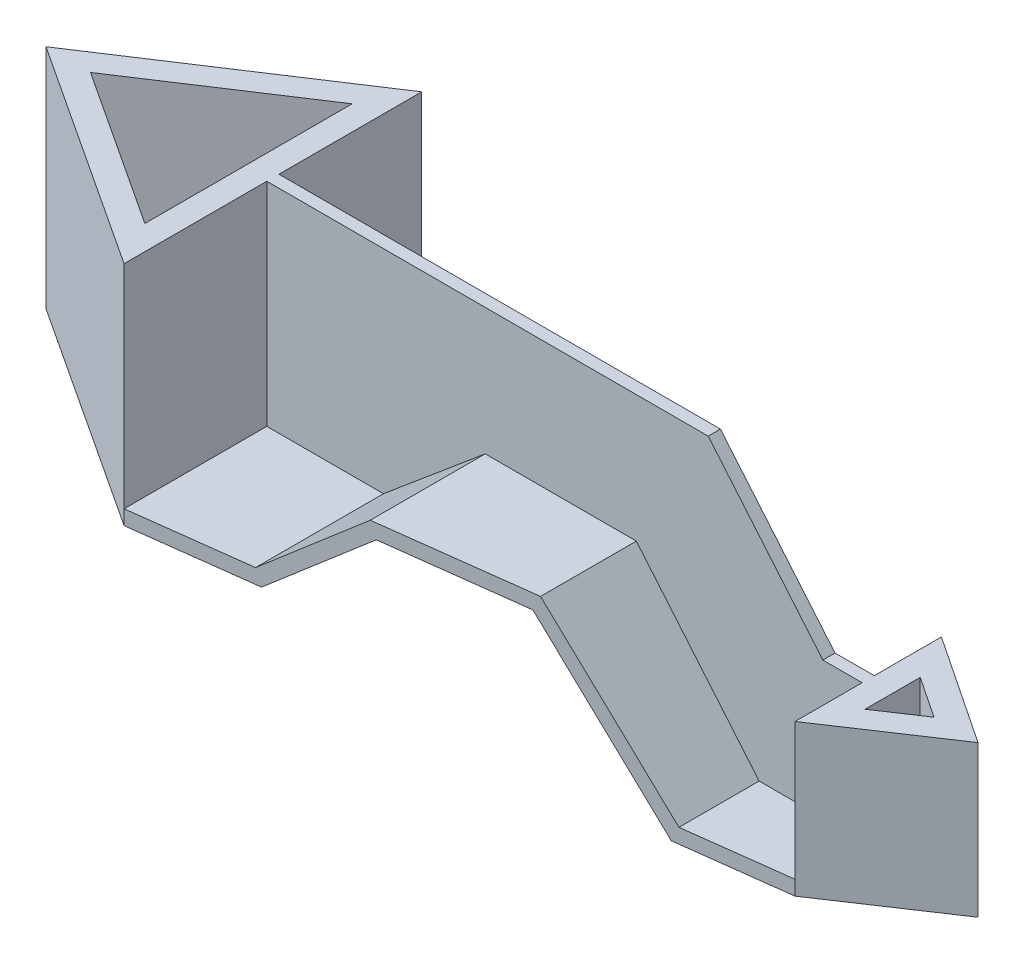
ISO-10303-21;
HEADER;
FILE_DESCRIPTION(('STEP AP214'),'2;1');
FILE_NAME('part.step','',(''),(''),'','','');
FILE_SCHEMA(('AUTOMOTIVE_DESIGN { 1 0 10303 214 1 1 1 1 }'));
ENDSEC;
DATA;
#1=APPLICATION_CONTEXT('core data for automotive mechanical design processes');
#2=APPLICATION_PROTOCOL_DEFINITION('international standard','automotive_design',2000,#1);
#3=PRODUCT_CONTEXT('',#1,'mechanical');
#4=PRODUCT('Part','Part','',(#3));
#5=PRODUCT_RELATED_PRODUCT_CATEGORY('part','',(#4));
#6=PRODUCT_DEFINITION_FORMATION('','',#4);
#7=PRODUCT_DEFINITION_CONTEXT('part definition',#1,'design');
#8=PRODUCT_DEFINITION('design','',#6,#7);
#9=PRODUCT_DEFINITION_SHAPE('','',#8);
#10=(LENGTH_UNIT() NAMED_UNIT(*) SI_UNIT(.MILLI.,.METRE.));
#11=(NAMED_UNIT(*) PLANE_ANGLE_UNIT() SI_UNIT($,.RADIAN.));
#12=(NAMED_UNIT(*) SI_UNIT($,.STERADIAN.) SOLID_ANGLE_UNIT());
#13=UNCERTAINTY_MEASURE_WITH_UNIT(LENGTH_MEASURE(1.E-05),#10,'distance_accuracy_value','');
#14=(GEOMETRIC_REPRESENTATION_CONTEXT(3) GLOBAL_UNCERTAINTY_ASSIGNED_CONTEXT((#13)) GLOBAL_UNIT_ASSIGNED_CONTEXT((#10,
#11,#12)) REPRESENTATION_CONTEXT('',''));
#15=CARTESIAN_POINT('',(0.,0.,0.));
#16=DIRECTION('',(0.,0.,1.));
#17=DIRECTION('',(1.,0.,0.));
#18=AXIS2_PLACEMENT_3D('',#15,#16,#17);
#19=CARTESIAN_POINT('',(0.,93.,61.));
#20=DIRECTION('',(-1.,0.,0.));
#21=DIRECTION('',(0.,0.,1.));
#22=AXIS2_PLACEMENT_3D('',#19,#20,#21);
#23=PLANE('',#22);
#24=DIRECTION('',(0.,-1.,0.));
#25=VECTOR('',#24,1.);
#26=CARTESIAN_POINT('',(0.,93.,-2.5));
#27=LINE('',#26,#25);
#28=CARTESIAN_POINT('',(0.,93.,-2.49999999999997));
#29=VERTEX_POINT('',#28);
#30=CARTESIAN_POINT('',(0.,6.,-2.49999999999997));
#31=VERTEX_POINT('',#30);
#32=EDGE_CURVE('E386',#29,#31,#27,.T.);
#33=ORIENTED_EDGE('',*,*,#32,.T.);
#34=DIRECTION('',(0.,0.,-1.));
#35=VECTOR('',#34,1.);
#36=CARTESIAN_POINT('',(0.,6.,61.));
#37=LINE('',#36,#35);
#38=CARTESIAN_POINT('',(0.,6.00000000000003,-61.));
#39=VERTEX_POINT('',#38);
#40=EDGE_CURVE('E296',#31,#39,#37,.T.);
#41=ORIENTED_EDGE('',*,*,#40,.T.);
#42=DIRECTION('',(0.,-1.,0.));
#43=VECTOR('',#42,1.);
#44=CARTESIAN_POINT('',(0.,93.,-61.));
#45=LINE('',#44,#43);
#46=CARTESIAN_POINT('',(0.,93.,-61.));
#47=VERTEX_POINT('',#46);
#48=EDGE_CURVE('E359',#47,#39,#45,.T.);
#49=ORIENTED_EDGE('',*,*,#48,.F.);
#50=DIRECTION('',(0.,0.,-1.));
#51=VECTOR('',#50,1.);
#52=CARTESIAN_POINT('',(0.,93.,61.));
#53=LINE('',#52,#51);
#54=EDGE_CURVE('E55',#29,#47,#53,.T.);
#55=ORIENTED_EDGE('',*,*,#54,.F.);
#56=EDGE_LOOP('',(#33,#41,#49,#55));
#57=FACE_BOUND('',#56,.T.);
#58=ADVANCED_FACE('F37',(#57),#23,.F.);
#59=CARTESIAN_POINT('',(201.79784594893,-19.,61.));
#60=DIRECTION('',(0.,-1.,0.));
#61=DIRECTION('',(0.,0.,-1.));
#62=AXIS2_PLACEMENT_3D('',#59,#60,#61);
#63=PLANE('',#62);
#64=DIRECTION('',(0.,0.,-1.));
#65=VECTOR('',#64,1.);
#66=CARTESIAN_POINT('',(244.,-19.,61.));
#67=LINE('',#66,#65);
#68=CARTESIAN_POINT('',(244.,-19.,-2.5));
#69=VERTEX_POINT('',#68);
#70=CARTESIAN_POINT('',(244.,-19.,-30.));
#71=VERTEX_POINT('',#70);
#72=EDGE_CURVE('E313',#69,#71,#67,.T.);
#73=ORIENTED_EDGE('',*,*,#72,.T.);
#74=DIRECTION('',(-0.992025662364217,0.,-0.126036047267585));
#75=VECTOR('',#74,1.);
#76=CARTESIAN_POINT('',(213.8460511499,-19.,-33.8310344850537));
#77=LINE('',#76,#75);
#78=CARTESIAN_POINT('',(201.79784594893,-19.,-35.3617490802589));
#79=VERTEX_POINT('',#78);
#80=EDGE_CURVE('E255',#71,#79,#77,.T.);
#81=ORIENTED_EDGE('',*,*,#80,.T.);
#82=DIRECTION('',(0.,0.,-1.));
#83=VECTOR('',#82,1.);
#84=CARTESIAN_POINT('',(201.79784594893,-19.,61.));
#85=LINE('',#84,#83);
#86=CARTESIAN_POINT('',(201.79784594893,-19.,-2.49999999999997));
#87=VERTEX_POINT('',#86);
#88=EDGE_CURVE('E310',#87,#79,#85,.T.);
#89=ORIENTED_EDGE('',*,*,#88,.F.);
#90=DIRECTION('',(1.,0.,0.));
#91=VECTOR('',#90,1.);
#92=CARTESIAN_POINT('',(201.79784594893,-19.,-2.5));
#93=LINE('',#92,#91);
#94=EDGE_CURVE('E430',#87,#69,#93,.T.);
#95=ORIENTED_EDGE('',*,*,#94,.T.);
#96=EDGE_LOOP('',(#73,#81,#89,#95));
#97=FACE_BOUND('',#96,.T.);
#98=ADVANCED_FACE('F580',(#97),#63,.F.);
#99=CARTESIAN_POINT('',(151.451868078293,41.,61.));
#100=DIRECTION('',(-0.766044443118979,-0.642787609686538,0.));
#101=DIRECTION('',(0.642787609686538,-0.766044443118979,0.));
#102=AXIS2_PLACEMENT_3D('',#99,#100,#101);
#103=PLANE('',#102);
#104=ORIENTED_EDGE('',*,*,#88,.T.);
#105=DIRECTION('',(-0.640654807784987,0.763502668790514,-0.0813946682021909));
#106=VECTOR('',#105,1.);
#107=CARTESIAN_POINT('',(156.810283549363,34.61408911174,-41.0773820080727));
#108=LINE('',#107,#106);
#109=CARTESIAN_POINT('',(151.451868078293,41.,-41.7581643015283));
#110=VERTEX_POINT('',#109);
#111=EDGE_CURVE('E550',#79,#110,#108,.T.);
#112=ORIENTED_EDGE('',*,*,#111,.T.);
#113=DIRECTION('',(0.,0.,-1.));
#114=VECTOR('',#113,1.);
#115=CARTESIAN_POINT('',(151.451868078293,41.,61.));
#116=LINE('',#115,#114);
#117=CARTESIAN_POINT('',(151.451868078293,41.,-2.49999999999997));
#118=VERTEX_POINT('',#117);
#119=EDGE_CURVE('E307',#118,#110,#116,.T.);
#120=ORIENTED_EDGE('',*,*,#119,.F.);
#121=DIRECTION('',(0.642787609686538,-0.766044443118979,0.));
#122=VECTOR('',#121,1.);
#123=CARTESIAN_POINT('',(151.451868078293,41.,-2.5));
#124=LINE('',#123,#122);
#125=EDGE_CURVE('E428',#118,#87,#124,.T.);
#126=ORIENTED_EDGE('',*,*,#125,.T.);
#127=EDGE_LOOP('',(#104,#112,#120,#126));
#128=FACE_BOUND('',#127,.T.);
#129=ADVANCED_FACE('F584',(#128),#103,.F.);
#130=CARTESIAN_POINT('',(89.5275543352001,41.,61.));
#131=DIRECTION('',(0.,-1.,0.));
#132=DIRECTION('',(0.,0.,-1.));
#133=AXIS2_PLACEMENT_3D('',#130,#131,#132);
#134=PLANE('',#133);
#135=ORIENTED_EDGE('',*,*,#119,.T.);
#136=DIRECTION('',(-0.992025662364217,0.,-0.126036047267585));
#137=VECTOR('',#136,1.);
#138=CARTESIAN_POINT('',(103.3591826851,41.,-47.8683005604997));
#139=LINE('',#138,#137);
#140=CARTESIAN_POINT('',(89.5275543352001,41.,-49.6255976049541));
#141=VERTEX_POINT('',#140);
#142=EDGE_CURVE('E547',#110,#141,#139,.T.);
#143=ORIENTED_EDGE('',*,*,#142,.T.);
#144=DIRECTION('',(0.,0.,-1.));
#145=VECTOR('',#144,1.);
#146=CARTESIAN_POINT('',(89.5275543352001,41.,61.));
#147=LINE('',#146,#145);
#148=CARTESIAN_POINT('',(89.5275543352001,41.,-2.49999999999997));
#149=VERTEX_POINT('',#148);
#150=EDGE_CURVE('E304',#149,#141,#147,.T.);
#151=ORIENTED_EDGE('',*,*,#150,.F.);
#152=DIRECTION('',(1.,0.,0.));
#153=VECTOR('',#152,1.);
#154=CARTESIAN_POINT('',(89.5275543352001,41.,-2.5));
#155=LINE('',#154,#153);
#156=EDGE_CURVE('E426',#149,#118,#155,.T.);
#157=ORIENTED_EDGE('',*,*,#156,.T.);
#158=EDGE_LOOP('',(#135,#143,#151,#157));
#159=FACE_BOUND('',#158,.T.);
#160=ADVANCED_FACE('F602',(#159),#134,.F.);
#161=CARTESIAN_POINT('',(47.8161785944028,6.,61.));
#162=DIRECTION('',(0.64278760968654,-0.766044443118977,0.));
#163=DIRECTION('',(0.766044443118977,0.64278760968654,0.));
#164=AXIS2_PLACEMENT_3D('',#161,#162,#163);
#165=PLANE('',#164);
#166=ORIENTED_EDGE('',*,*,#150,.T.);
#167=DIRECTION('',(-0.762441945897458,-0.639764755596646,-0.0968676242738574));
#168=VECTOR('',#167,1.);
#169=CARTESIAN_POINT('',(56.3779279675641,13.184160741252,-53.8372304631373));
#170=LINE('',#169,#168);
#171=CARTESIAN_POINT('',(47.8161785944028,6.,-54.9249937031702));
#172=VERTEX_POINT('',#171);
#173=EDGE_CURVE('E544',#141,#172,#170,.T.);
#174=ORIENTED_EDGE('',*,*,#173,.T.);
#175=DIRECTION('',(0.,0.,-1.));
#176=VECTOR('',#175,1.);
#177=CARTESIAN_POINT('',(47.8161785944028,6.,61.));
#178=LINE('',#177,#176);
#179=CARTESIAN_POINT('',(47.8161785944028,6.,-2.49999999999997));
#180=VERTEX_POINT('',#179);
#181=EDGE_CURVE('E301',#180,#172,#178,.T.);
#182=ORIENTED_EDGE('',*,*,#181,.F.);
#183=DIRECTION('',(0.766044443118977,0.64278760968654,0.));
#184=VECTOR('',#183,1.);
#185=CARTESIAN_POINT('',(47.8161785944028,6.,-2.5));
#186=LINE('',#185,#184);
#187=EDGE_CURVE('E424',#180,#149,#186,.T.);
#188=ORIENTED_EDGE('',*,*,#187,.T.);
#189=EDGE_LOOP('',(#166,#174,#182,#188));
#190=FACE_BOUND('',#189,.T.);
#191=ADVANCED_FACE('F599',(#190),#165,.F.);
#192=CARTESIAN_POINT('',(0.,6.,61.));
#193=DIRECTION('',(0.,-1.,0.));
#194=DIRECTION('',(0.,0.,-1.));
#195=AXIS2_PLACEMENT_3D('',#192,#193,#194);
#196=PLANE('',#195);
#197=ORIENTED_EDGE('',*,*,#181,.T.);
#198=DIRECTION('',(-0.992025662364217,0.,-0.126036047267585));
#199=VECTOR('',#198,1.);
#200=CARTESIAN_POINT('',(15.253781179232,6.,-59.0620196042779));
#201=LINE('',#200,#199);
#202=EDGE_CURVE('E537',#172,#39,#201,.T.);
#203=ORIENTED_EDGE('',*,*,#202,.T.);
#204=ORIENTED_EDGE('',*,*,#40,.F.);
#205=DIRECTION('',(1.,0.,0.));
#206=VECTOR('',#205,1.);
#207=CARTESIAN_POINT('',(0.,6.,-2.5));
#208=LINE('',#207,#206);
#209=EDGE_CURVE('E389',#31,#180,#208,.T.);
#210=ORIENTED_EDGE('',*,*,#209,.T.);
#211=EDGE_LOOP('',(#197,#203,#204,#210));
#212=FACE_BOUND('',#211,.T.);
#213=ADVANCED_FACE('F592',(#212),#196,.F.);
#214=CARTESIAN_POINT('',(244.,37.,61.));
#215=DIRECTION('',(1.,0.,0.));
#216=DIRECTION('',(0.,0.,-1.));
#217=AXIS2_PLACEMENT_3D('',#214,#215,#216);
#218=PLANE('',#217);
#219=DIRECTION('',(0.,1.,0.));
#220=VECTOR('',#219,1.);
#221=CARTESIAN_POINT('',(244.,-19.,-2.5));
#222=LINE('',#221,#220);
#223=CARTESIAN_POINT('',(244.,37.,-2.5));
#224=VERTEX_POINT('',#223);
#225=EDGE_CURVE('E433',#69,#224,#222,.T.);
#226=ORIENTED_EDGE('',*,*,#225,.T.);
#227=DIRECTION('',(0.,0.,1.));
#228=VECTOR('',#227,1.);
#229=CARTESIAN_POINT('',(244.,37.,61.));
#230=LINE('',#229,#228);
#231=CARTESIAN_POINT('',(244.,37.,-30.));
#232=VERTEX_POINT('',#231);
#233=EDGE_CURVE('E284',#232,#224,#230,.T.);
#234=ORIENTED_EDGE('',*,*,#233,.F.);
#235=DIRECTION('',(0.,-1.,0.));
#236=VECTOR('',#235,1.);
#237=CARTESIAN_POINT('',(244.,37.,-30.));
#238=LINE('',#237,#236);
#239=EDGE_CURVE('E262',#232,#71,#238,.T.);
#240=ORIENTED_EDGE('',*,*,#239,.T.);
#241=ORIENTED_EDGE('',*,*,#72,.F.);
#242=EDGE_LOOP('',(#226,#234,#240,#241));
#243=FACE_BOUND('',#242,.T.);
#244=ADVANCED_FACE('F477',(#243),#218,.F.);
#245=CARTESIAN_POINT('',(0.,93.,0.));
#246=DIRECTION('',(0.,1.,0.));
#247=DIRECTION('',(0.,0.,1.));
#248=AXIS2_PLACEMENT_3D('',#245,#246,#247);
#249=PLANE('',#248);
#250=DIRECTION('',(-0.836176771121185,0.,0.548460032670885));
#251=VECTOR('',#250,1.);
#252=CARTESIAN_POINT('',(0.,93.,-61.));
#253=LINE('',#252,#251);
#254=CARTESIAN_POINT('',(-93.,93.,0.));
#255=VERTEX_POINT('',#254);
#256=EDGE_CURVE('E351',#47,#255,#253,.T.);
#257=ORIENTED_EDGE('',*,*,#256,.T.);
#258=DIRECTION('',(0.836176771121185,0.,0.548460032670885));
#259=VECTOR('',#258,1.);
#260=CARTESIAN_POINT('',(-93.,93.,0.));
#261=LINE('',#260,#259);
#262=CARTESIAN_POINT('',(0.,93.,61.));
#263=VERTEX_POINT('',#262);
#264=EDGE_CURVE('E354',#255,#263,#261,.T.);
#265=ORIENTED_EDGE('',*,*,#264,.T.);
#266=CARTESIAN_POINT('',(0.,93.,2.50000000000002));
#267=VERTEX_POINT('',#266);
#268=EDGE_CURVE('E357',#263,#267,#53,.T.);
#269=ORIENTED_EDGE('',*,*,#268,.T.);
#270=DIRECTION('',(-1.,0.,0.));
#271=VECTOR('',#270,1.);
#272=CARTESIAN_POINT('',(0.,93.,2.5));
#273=LINE('',#272,#271);
#274=CARTESIAN_POINT('',(180.921495459683,93.,2.5));
#275=VERTEX_POINT('',#274);
#276=EDGE_CURVE('E419',#275,#267,#273,.T.);
#277=ORIENTED_EDGE('',*,*,#276,.F.);
#278=DIRECTION('',(0.,0.,-1.));
#279=VECTOR('',#278,1.);
#280=CARTESIAN_POINT('',(180.921495459683,93.,2.5));
#281=LINE('',#280,#279);
#282=CARTESIAN_POINT('',(180.921495459683,93.,-2.5));
#283=VERTEX_POINT('',#282);
#284=EDGE_CURVE('E421',#275,#283,#281,.T.);
#285=ORIENTED_EDGE('',*,*,#284,.T.);
#286=DIRECTION('',(-1.,0.,0.));
#287=VECTOR('',#286,1.);
#288=CARTESIAN_POINT('',(0.,93.,-2.5));
#289=LINE('',#288,#287);
#290=EDGE_CURVE('E397',#283,#29,#289,.T.);
#291=ORIENTED_EDGE('',*,*,#290,.T.);
#292=ORIENTED_EDGE('',*,*,#54,.T.);
#293=EDGE_LOOP('',(#257,#265,#269,#277,#285,#291,#292));
#294=FACE_BOUND('',#293,.T.);
#295=DIRECTION('',(-0.836176771121186,0.,0.548460032670885));
#296=VECTOR('',#295,1.);
#297=CARTESIAN_POINT('',(-10.,93.,-42.4816664830974));
#298=LINE('',#297,#296);
#299=CARTESIAN_POINT('',(-10.,93.,-42.4816664830974));
#300=VERTEX_POINT('',#299);
#301=CARTESIAN_POINT('',(-74.7671308676731,93.,0.));
#302=VERTEX_POINT('',#301);
#303=EDGE_CURVE('E329',#300,#302,#298,.T.);
#304=ORIENTED_EDGE('',*,*,#303,.F.);
#305=DIRECTION('',(0.,0.,-1.));
#306=VECTOR('',#305,1.);
#307=CARTESIAN_POINT('',(-10.,93.,42.4816664830974));
#308=LINE('',#307,#306);
#309=CARTESIAN_POINT('',(-10.,93.,42.4816664830974));
#310=VERTEX_POINT('',#309);
#311=EDGE_CURVE('E327',#310,#300,#308,.T.);
#312=ORIENTED_EDGE('',*,*,#311,.F.);
#313=DIRECTION('',(0.836176771121185,0.,0.548460032670885));
#314=VECTOR('',#313,1.);
#315=CARTESIAN_POINT('',(-74.7671308676731,93.,0.));
#316=LINE('',#315,#314);
#317=EDGE_CURVE('E333',#302,#310,#316,.T.);
#318=ORIENTED_EDGE('',*,*,#317,.F.);
#319=EDGE_LOOP('',(#304,#312,#318));
#320=FACE_BOUND('',#319,.T.);
#321=ADVANCED_FACE('F638',(#294,#320),#249,.T.);
#322=CARTESIAN_POINT('',(0.,0.,0.));
#323=DIRECTION('',(0.,1.,0.));
#324=DIRECTION('',(0.,0.,1.));
#325=AXIS2_PLACEMENT_3D('',#322,#323,#324);
#326=PLANE('',#325);
#327=DIRECTION('',(-0.836176771121185,0.,0.548460032670885));
#328=VECTOR('',#327,1.);
#329=CARTESIAN_POINT('',(0.,0.,-61.));
#330=LINE('',#329,#328);
#331=CARTESIAN_POINT('',(0.,0.,-61.));
#332=VERTEX_POINT('',#331);
#333=CARTESIAN_POINT('',(-93.,0.,0.));
#334=VERTEX_POINT('',#333);
#335=EDGE_CURVE('E350',#332,#334,#330,.T.);
#336=ORIENTED_EDGE('',*,*,#335,.F.);
#337=DIRECTION('',(0.992025662364217,0.,0.126036047267585));
#338=VECTOR('',#337,1.);
#339=CARTESIAN_POINT('',(7.62689058961601,0.,-60.031009802139));
#340=LINE('',#339,#338);
#341=CARTESIAN_POINT('',(50.,0.,-54.6475409836066));
#342=VERTEX_POINT('',#341);
#343=EDGE_CURVE('E381',#332,#342,#340,.T.);
#344=ORIENTED_EDGE('',*,*,#343,.T.);
#345=DIRECTION('',(0.,0.,-1.));
#346=VECTOR('',#345,1.);
#347=CARTESIAN_POINT('',(50.,0.,61.));
#348=LINE('',#347,#346);
#349=CARTESIAN_POINT('',(50.,0.,54.6475409836066));
#350=VERTEX_POINT('',#349);
#351=EDGE_CURVE('E323',#350,#342,#348,.T.);
#352=ORIENTED_EDGE('',*,*,#351,.F.);
#353=DIRECTION('',(-0.992025662364217,0.,0.126036047267585));
#354=VECTOR('',#353,1.);
#355=CARTESIAN_POINT('',(7.62689058961601,0.,60.031009802139));
#356=LINE('',#355,#354);
#357=CARTESIAN_POINT('',(0.,0.,61.));
#358=VERTEX_POINT('',#357);
#359=EDGE_CURVE('E383',#350,#358,#356,.T.);
#360=ORIENTED_EDGE('',*,*,#359,.T.);
#361=DIRECTION('',(0.836176771121185,0.,0.548460032670885));
#362=VECTOR('',#361,1.);
#363=CARTESIAN_POINT('',(-93.,0.,0.));
#364=LINE('',#363,#362);
#365=EDGE_CURVE('E355',#334,#358,#364,.T.);
#366=ORIENTED_EDGE('',*,*,#365,.F.);
#367=EDGE_LOOP('',(#336,#344,#352,#360,#366));
#368=FACE_BOUND('',#367,.T.);
#369=DIRECTION('',(0.,0.,-1.));
#370=VECTOR('',#369,1.);
#371=CARTESIAN_POINT('',(-10.,0.,42.4816664830974));
#372=LINE('',#371,#370);
#373=CARTESIAN_POINT('',(-10.,0.,42.4816664830974));
#374=VERTEX_POINT('',#373);
#375=CARTESIAN_POINT('',(-10.,0.,-42.4816664830974));
#376=VERTEX_POINT('',#375);
#377=EDGE_CURVE('E326',#374,#376,#372,.T.);
#378=ORIENTED_EDGE('',*,*,#377,.T.);
#379=DIRECTION('',(-0.836176771121186,0.,0.548460032670885));
#380=VECTOR('',#379,1.);
#381=CARTESIAN_POINT('',(-10.,0.,-42.4816664830974));
#382=LINE('',#381,#380);
#383=CARTESIAN_POINT('',(-74.7671308676731,0.,0.));
#384=VERTEX_POINT('',#383);
#385=EDGE_CURVE('E338',#376,#384,#382,.T.);
#386=ORIENTED_EDGE('',*,*,#385,.T.);
#387=DIRECTION('',(0.836176771121185,0.,0.548460032670885));
#388=VECTOR('',#387,1.);
#389=CARTESIAN_POINT('',(-74.7671308676731,0.,0.));
#390=LINE('',#389,#388);
#391=EDGE_CURVE('E330',#384,#374,#390,.T.);
#392=ORIENTED_EDGE('',*,*,#391,.T.);
#393=EDGE_LOOP('',(#378,#386,#392));
#394=FACE_BOUND('',#393,.T.);
#395=ADVANCED_FACE('F378',(#368,#394),#326,.F.);
#396=CARTESIAN_POINT('',(0.,93.,-61.));
#397=DIRECTION('',(0.548460032670885,0.,0.836176771121185));
#398=DIRECTION('',(0.836176771121186,0.,-0.548460032670885));
#399=AXIS2_PLACEMENT_3D('',#396,#397,#398);
#400=PLANE('',#399);
#401=ORIENTED_EDGE('',*,*,#335,.T.);
#402=DIRECTION('',(0.,-1.,0.));
#403=VECTOR('',#402,1.);
#404=CARTESIAN_POINT('',(-93.,93.,0.));
#405=LINE('',#404,#403);
#406=EDGE_CURVE('E41',#255,#334,#405,.T.);
#407=ORIENTED_EDGE('',*,*,#406,.F.);
#408=ORIENTED_EDGE('',*,*,#256,.F.);
#409=ORIENTED_EDGE('',*,*,#48,.T.);
#410=DIRECTION('',(0.,-1.,0.));
#411=VECTOR('',#410,1.);
#412=CARTESIAN_POINT('',(0.,6.,-61.));
#413=LINE('',#412,#411);
#414=EDGE_CURVE('E293',#39,#332,#413,.T.);
#415=ORIENTED_EDGE('',*,*,#414,.T.);
#416=EDGE_LOOP('',(#401,#407,#408,#409,#415));
#417=FACE_BOUND('',#416,.T.);
#418=ADVANCED_FACE('F39',(#417),#400,.F.);
#419=CARTESIAN_POINT('',(-93.,93.,0.));
#420=DIRECTION('',(0.548460032670885,0.,-0.836176771121185));
#421=DIRECTION('',(-0.836176771121186,0.,-0.548460032670885));
#422=AXIS2_PLACEMENT_3D('',#419,#420,#421);
#423=PLANE('',#422);
#424=ORIENTED_EDGE('',*,*,#365,.T.);
#425=DIRECTION('',(0.,-1.,0.));
#426=VECTOR('',#425,1.);
#427=CARTESIAN_POINT('',(0.,6.,61.));
#428=LINE('',#427,#426);
#429=CARTESIAN_POINT('',(0.,5.99999999999999,61.));
#430=VERTEX_POINT('',#429);
#431=EDGE_CURVE('E294',#430,#358,#428,.T.);
#432=ORIENTED_EDGE('',*,*,#431,.F.);
#433=DIRECTION('',(0.,-1.,0.));
#434=VECTOR('',#433,1.);
#435=CARTESIAN_POINT('',(0.,93.,61.));
#436=LINE('',#435,#434);
#437=EDGE_CURVE('E365',#263,#430,#436,.T.);
#438=ORIENTED_EDGE('',*,*,#437,.F.);
#439=ORIENTED_EDGE('',*,*,#264,.F.);
#440=ORIENTED_EDGE('',*,*,#406,.T.);
#441=EDGE_LOOP('',(#424,#432,#438,#439,#440));
#442=FACE_BOUND('',#441,.T.);
#443=ADVANCED_FACE('F371',(#442),#423,.F.);
#444=CARTESIAN_POINT('',(0.,6.,2.50000000000002));
#445=VERTEX_POINT('',#444);
#446=EDGE_CURVE('E299',#430,#445,#37,.T.);
#447=ORIENTED_EDGE('',*,*,#446,.T.);
#448=DIRECTION('',(0.,-1.,0.));
#449=VECTOR('',#448,1.);
#450=CARTESIAN_POINT('',(0.,93.,2.5));
#451=LINE('',#450,#449);
#452=EDGE_CURVE('E63',#267,#445,#451,.T.);
#453=ORIENTED_EDGE('',*,*,#452,.F.);
#454=ORIENTED_EDGE('',*,*,#268,.F.);
#455=ORIENTED_EDGE('',*,*,#437,.T.);
#456=EDGE_LOOP('',(#447,#453,#454,#455));
#457=FACE_BOUND('',#456,.T.);
#458=ADVANCED_FACE('F567',(#457),#23,.F.);
#459=CARTESIAN_POINT('',(-10.,93.,42.4816664830974));
#460=DIRECTION('',(-1.,0.,0.));
#461=DIRECTION('',(0.,0.,1.));
#462=AXIS2_PLACEMENT_3D('',#459,#460,#461);
#463=PLANE('',#462);
#464=ORIENTED_EDGE('',*,*,#377,.F.);
#465=DIRECTION('',(0.,-1.,0.));
#466=VECTOR('',#465,1.);
#467=CARTESIAN_POINT('',(-10.,93.,42.4816664830974));
#468=LINE('',#467,#466);
#469=EDGE_CURVE('E335',#310,#374,#468,.T.);
#470=ORIENTED_EDGE('',*,*,#469,.F.);
#471=ORIENTED_EDGE('',*,*,#311,.T.);
#472=DIRECTION('',(0.,-1.,0.));
#473=VECTOR('',#472,1.);
#474=CARTESIAN_POINT('',(-10.,93.,-42.4816664830974));
#475=LINE('',#474,#473);
#476=EDGE_CURVE('E347',#300,#376,#475,.T.);
#477=ORIENTED_EDGE('',*,*,#476,.T.);
#478=EDGE_LOOP('',(#464,#470,#471,#477));
#479=FACE_BOUND('',#478,.T.);
#480=ADVANCED_FACE('F569',(#479),#463,.T.);
#481=CARTESIAN_POINT('',(-10.,93.,-42.4816664830974));
#482=DIRECTION('',(0.548460032670885,0.,0.836176771121186));
#483=DIRECTION('',(0.836176771121186,0.,-0.548460032670885));
#484=AXIS2_PLACEMENT_3D('',#481,#482,#483);
#485=PLANE('',#484);
#486=ORIENTED_EDGE('',*,*,#385,.F.);
#487=ORIENTED_EDGE('',*,*,#476,.F.);
#488=ORIENTED_EDGE('',*,*,#303,.T.);
#489=DIRECTION('',(0.,-1.,0.));
#490=VECTOR('',#489,1.);
#491=CARTESIAN_POINT('',(-74.7671308676731,93.,0.));
#492=LINE('',#491,#490);
#493=EDGE_CURVE('E345',#302,#384,#492,.T.);
#494=ORIENTED_EDGE('',*,*,#493,.T.);
#495=EDGE_LOOP('',(#486,#487,#488,#494));
#496=FACE_BOUND('',#495,.T.);
#497=ADVANCED_FACE('F575',(#496),#485,.T.);
#498=CARTESIAN_POINT('',(-74.7671308676731,93.,0.));
#499=DIRECTION('',(0.548460032670885,0.,-0.836176771121186));
#500=DIRECTION('',(-0.836176771121186,0.,-0.548460032670885));
#501=AXIS2_PLACEMENT_3D('',#498,#499,#500);
#502=PLANE('',#501);
#503=ORIENTED_EDGE('',*,*,#391,.F.);
#504=ORIENTED_EDGE('',*,*,#493,.F.);
#505=ORIENTED_EDGE('',*,*,#317,.T.);
#506=ORIENTED_EDGE('',*,*,#469,.T.);
#507=EDGE_LOOP('',(#503,#504,#505,#506));
#508=FACE_BOUND('',#507,.T.);
#509=ADVANCED_FACE('F631',(#508),#502,.T.);
#510=CARTESIAN_POINT('',(50.,0.,61.));
#511=DIRECTION('',(-0.64278760968654,0.766044443118977,0.));
#512=DIRECTION('',(-0.766044443118977,-0.64278760968654,0.));
#513=AXIS2_PLACEMENT_3D('',#510,#511,#512);
#514=PLANE('',#513);
#515=ORIENTED_EDGE('',*,*,#351,.T.);
#516=DIRECTION('',(0.762441945897458,0.639764755596646,0.0968676242738573));
#517=VECTOR('',#516,1.);
#518=CARTESIAN_POINT('',(58.5412578417674,7.16696630481711,-53.562381175841));
#519=LINE('',#518,#517);
#520=CARTESIAN_POINT('',(91.7113757407973,35.,-49.3481448853905));
#521=VERTEX_POINT('',#520);
#522=EDGE_CURVE('E534',#342,#521,#519,.T.);
#523=ORIENTED_EDGE('',*,*,#522,.T.);
#524=DIRECTION('',(0.,0.,-1.));
#525=VECTOR('',#524,1.);
#526=CARTESIAN_POINT('',(91.7113757407973,35.,61.));
#527=LINE('',#526,#525);
#528=CARTESIAN_POINT('',(91.7113757407973,35.,49.3481448853905));
#529=VERTEX_POINT('',#528);
#530=EDGE_CURVE('E320',#529,#521,#527,.T.);
#531=ORIENTED_EDGE('',*,*,#530,.F.);
#532=DIRECTION('',(-0.762441945897458,-0.639764755596646,0.0968676242738573));
#533=VECTOR('',#532,1.);
#534=CARTESIAN_POINT('',(49.530833168377,-0.393677715375524,54.7071482450013));
#535=LINE('',#534,#533);
#536=EDGE_CURVE('E387',#529,#350,#535,.T.);
#537=ORIENTED_EDGE('',*,*,#536,.T.);
#538=EDGE_LOOP('',(#515,#523,#531,#537));
#539=FACE_BOUND('',#538,.T.);
#540=ADVANCED_FACE('F533',(#539),#514,.F.);
#541=CARTESIAN_POINT('',(91.7113757407973,35.,61.));
#542=DIRECTION('',(0.,1.,0.));
#543=DIRECTION('',(0.,0.,1.));
#544=AXIS2_PLACEMENT_3D('',#541,#542,#543);
#545=PLANE('',#544);
#546=ORIENTED_EDGE('',*,*,#530,.T.);
#547=DIRECTION('',(0.992025662364217,0.,0.126036047267585));
#548=VECTOR('',#547,1.);
#549=CARTESIAN_POINT('',(105.508313901584,35.,-47.5952552010283));
#550=LINE('',#549,#548);
#551=CARTESIAN_POINT('',(148.654022129363,35.,-42.1136283360235));
#552=VERTEX_POINT('',#551);
#553=EDGE_CURVE('E535',#521,#552,#550,.T.);
#554=ORIENTED_EDGE('',*,*,#553,.T.);
#555=DIRECTION('',(0.,0.,-1.));
#556=VECTOR('',#555,1.);
#557=CARTESIAN_POINT('',(148.654022129363,35.,61.));
#558=LINE('',#557,#556);
#559=CARTESIAN_POINT('',(148.654022129363,35.,42.1136283360235));
#560=VERTEX_POINT('',#559);
#561=EDGE_CURVE('E317',#560,#552,#558,.T.);
#562=ORIENTED_EDGE('',*,*,#561,.F.);
#563=DIRECTION('',(-0.992025662364217,0.,0.126036047267585));
#564=VECTOR('',#563,1.);
#565=CARTESIAN_POINT('',(90.2545327223516,35.,49.5332355967504));
#566=LINE('',#565,#564);
#567=EDGE_CURVE('E391',#560,#529,#566,.T.);
#568=ORIENTED_EDGE('',*,*,#567,.T.);
#569=EDGE_LOOP('',(#546,#554,#562,#568));
#570=FACE_BOUND('',#569,.T.);
#571=ADVANCED_FACE('F529',(#570),#545,.F.);
#572=CARTESIAN_POINT('',(148.654022129363,35.,61.));
#573=DIRECTION('',(0.766044443118979,0.642787609686538,0.));
#574=DIRECTION('',(-0.642787609686538,0.766044443118979,0.));
#575=AXIS2_PLACEMENT_3D('',#572,#573,#574);
#576=PLANE('',#575);
#577=ORIENTED_EDGE('',*,*,#561,.T.);
#578=DIRECTION('',(0.640654807784986,-0.763502668790514,0.0813946682021909));
#579=VECTOR('',#578,1.);
#580=CARTESIAN_POINT('',(154.03097358728,28.5919987828235,-41.4304910606325));
#581=LINE('',#580,#579);
#582=CARTESIAN_POINT('',(199.,-25.,-35.7172131147541));
#583=VERTEX_POINT('',#582);
#584=EDGE_CURVE('E273',#552,#583,#581,.T.);
#585=ORIENTED_EDGE('',*,*,#584,.T.);
#586=DIRECTION('',(0.,0.,-1.));
#587=VECTOR('',#586,1.);
#588=CARTESIAN_POINT('',(199.,-25.,61.));
#589=LINE('',#588,#587);
#590=CARTESIAN_POINT('',(199.,-25.,35.7172131147541));
#591=VERTEX_POINT('',#590);
#592=EDGE_CURVE('E272',#591,#583,#589,.T.);
#593=ORIENTED_EDGE('',*,*,#592,.F.);
#594=DIRECTION('',(-0.640654807784986,0.763502668790514,0.0813946682021909));
#595=VECTOR('',#594,1.);
#596=CARTESIAN_POINT('',(147.66917555484,36.1736944433419,42.2387522860654));
#597=LINE('',#596,#595);
#598=EDGE_CURVE('E518',#591,#560,#597,.T.);
#599=ORIENTED_EDGE('',*,*,#598,.T.);
#600=EDGE_LOOP('',(#577,#585,#593,#599));
#601=FACE_BOUND('',#600,.T.);
#602=ADVANCED_FACE('F621',(#601),#576,.F.);
#603=CARTESIAN_POINT('',(199.,-25.,61.));
#604=DIRECTION('',(0.,1.,0.));
#605=DIRECTION('',(-1.,0.,0.));
#606=AXIS2_PLACEMENT_3D('',#603,#604,#605);
#607=PLANE('',#606);
#608=ORIENTED_EDGE('',*,*,#592,.T.);
#609=DIRECTION('',(0.992025662364217,0.,0.126036047267585));
#610=VECTOR('',#609,1.);
#611=CARTESIAN_POINT('',(244.,-25.,-30.));
#612=LINE('',#611,#610);
#613=CARTESIAN_POINT('',(244.,-25.,-30.));
#614=VERTEX_POINT('',#613);
#615=EDGE_CURVE('E252',#583,#614,#612,.T.);
#616=ORIENTED_EDGE('',*,*,#615,.T.);
#617=DIRECTION('',(-0.832050294337844,0.,-0.554700196225229));
#618=VECTOR('',#617,1.);
#619=CARTESIAN_POINT('',(254.846153846154,-25.,-22.7692307692308));
#620=LINE('',#619,#618);
#621=CARTESIAN_POINT('',(289.,-25.,0.));
#622=VERTEX_POINT('',#621);
#623=EDGE_CURVE('E269',#622,#614,#620,.T.);
#624=ORIENTED_EDGE('',*,*,#623,.F.);
#625=DIRECTION('',(0.832050294337844,0.,-0.554700196225229));
#626=VECTOR('',#625,1.);
#627=CARTESIAN_POINT('',(198.538461538462,-25.,60.3076923076923));
#628=LINE('',#627,#626);
#629=CARTESIAN_POINT('',(244.,-25.,30.));
#630=VERTEX_POINT('',#629);
#631=EDGE_CURVE('E282',#630,#622,#628,.T.);
#632=ORIENTED_EDGE('',*,*,#631,.F.);
#633=DIRECTION('',(-0.992025662364217,0.,0.126036047267585));
#634=VECTOR('',#633,1.);
#635=CARTESIAN_POINT('',(0.,-25.,61.));
#636=LINE('',#635,#634);
#637=EDGE_CURVE('E274',#630,#591,#636,.T.);
#638=ORIENTED_EDGE('',*,*,#637,.T.);
#639=EDGE_LOOP('',(#608,#616,#624,#632,#638));
#640=FACE_BOUND('',#639,.T.);
#641=DIRECTION('',(0.,0.,1.));
#642=VECTOR('',#641,1.);
#643=CARTESIAN_POINT('',(254.,-25.,61.));
#644=LINE('',#643,#642);
#645=CARTESIAN_POINT('',(254.,-25.,-11.3148290817867));
#646=VERTEX_POINT('',#645);
#647=CARTESIAN_POINT('',(254.,-25.,11.3148290817867));
#648=VERTEX_POINT('',#647);
#649=EDGE_CURVE('E445',#646,#648,#644,.T.);
#650=ORIENTED_EDGE('',*,*,#649,.T.);
#651=DIRECTION('',(0.832050294337844,0.,-0.554700196225229));
#652=VECTOR('',#651,1.);
#653=CARTESIAN_POINT('',(192.991459576209,-25.,51.9871893643139));
#654=LINE('',#653,#652);
#655=CARTESIAN_POINT('',(270.97224362268,-25.,0.));
#656=VERTEX_POINT('',#655);
#657=EDGE_CURVE('E457',#648,#656,#654,.T.);
#658=ORIENTED_EDGE('',*,*,#657,.T.);
#659=DIRECTION('',(-0.832050294337844,0.,-0.554700196225229));
#660=VECTOR('',#659,1.);
#661=CARTESIAN_POINT('',(249.299151883902,-25.,-14.4487278258524));
#662=LINE('',#661,#660);
#663=EDGE_CURVE('E449',#656,#646,#662,.T.);
#664=ORIENTED_EDGE('',*,*,#663,.T.);
#665=EDGE_LOOP('',(#650,#658,#664));
#666=FACE_BOUND('',#665,.T.);
#667=ADVANCED_FACE('F266',(#640,#666),#607,.F.);
#668=CARTESIAN_POINT('',(201.79784594893,-19.,35.3617490802589));
#669=VERTEX_POINT('',#668);
#670=CARTESIAN_POINT('',(201.79784594893,-19.,2.50000000000002));
#671=VERTEX_POINT('',#670);
#672=EDGE_CURVE('E311',#669,#671,#85,.T.);
#673=ORIENTED_EDGE('',*,*,#672,.F.);
#674=DIRECTION('',(0.992025662364217,0.,-0.126036047267585));
#675=VECTOR('',#674,1.);
#676=CARTESIAN_POINT('',(198.592269970668,-19.,35.7690148807758));
#677=LINE('',#676,#675);
#678=CARTESIAN_POINT('',(244.,-19.,30.));
#679=VERTEX_POINT('',#678);
#680=EDGE_CURVE('E507',#669,#679,#677,.T.);
#681=ORIENTED_EDGE('',*,*,#680,.T.);
#682=CARTESIAN_POINT('',(244.,-19.,2.50000000000002));
#683=VERTEX_POINT('',#682);
#684=EDGE_CURVE('E315',#679,#683,#67,.T.);
#685=ORIENTED_EDGE('',*,*,#684,.T.);
#686=DIRECTION('',(1.,0.,0.));
#687=VECTOR('',#686,1.);
#688=CARTESIAN_POINT('',(201.79784594893,-19.,2.5));
#689=LINE('',#688,#687);
#690=EDGE_CURVE('E409',#671,#683,#689,.T.);
#691=ORIENTED_EDGE('',*,*,#690,.F.);
#692=EDGE_LOOP('',(#673,#681,#685,#691));
#693=FACE_BOUND('',#692,.T.);
#694=ADVANCED_FACE('F506',(#693),#63,.F.);
#695=CARTESIAN_POINT('',(151.451868078293,41.,41.7581643015283));
#696=VERTEX_POINT('',#695);
#697=CARTESIAN_POINT('',(151.451868078293,41.,2.50000000000002));
#698=VERTEX_POINT('',#697);
#699=EDGE_CURVE('E308',#696,#698,#116,.T.);
#700=ORIENTED_EDGE('',*,*,#699,.F.);
#701=DIRECTION('',(0.640654807784987,-0.763502668790514,-0.0813946682021909));
#702=VECTOR('',#701,1.);
#703=CARTESIAN_POINT('',(150.448485516924,42.1957847722583,41.8856432335055));
#704=LINE('',#703,#702);
#705=EDGE_CURVE('E514',#696,#669,#704,.T.);
#706=ORIENTED_EDGE('',*,*,#705,.T.);
#707=ORIENTED_EDGE('',*,*,#672,.T.);
#708=DIRECTION('',(0.642787609686538,-0.766044443118979,0.));
#709=VECTOR('',#708,1.);
#710=CARTESIAN_POINT('',(151.451868078293,41.,2.5));
#711=LINE('',#710,#709);
#712=EDGE_CURVE('E406',#698,#671,#711,.T.);
#713=ORIENTED_EDGE('',*,*,#712,.F.);
#714=EDGE_LOOP('',(#700,#706,#707,#713));
#715=FACE_BOUND('',#714,.T.);
#716=ADVANCED_FACE('F512',(#715),#103,.F.);
#717=CARTESIAN_POINT('',(89.5275543352001,41.,49.6255976049541));
#718=VERTEX_POINT('',#717);
#719=CARTESIAN_POINT('',(89.5275543352001,41.,2.50000000000002));
#720=VERTEX_POINT('',#719);
#721=EDGE_CURVE('E305',#718,#720,#147,.T.);
#722=ORIENTED_EDGE('',*,*,#721,.F.);
#723=DIRECTION('',(0.992025662364217,0.,-0.126036047267585));
#724=VECTOR('',#723,1.);
#725=CARTESIAN_POINT('',(88.1054015058676,41.,49.8062809562217));
#726=LINE('',#725,#724);
#727=EDGE_CURVE('E516',#718,#696,#726,.T.);
#728=ORIENTED_EDGE('',*,*,#727,.T.);
#729=ORIENTED_EDGE('',*,*,#699,.T.);
#730=DIRECTION('',(1.,0.,0.));
#731=VECTOR('',#730,1.);
#732=CARTESIAN_POINT('',(89.5275543352001,41.,2.5));
#733=LINE('',#732,#731);
#734=EDGE_CURVE('E403',#720,#698,#733,.T.);
#735=ORIENTED_EDGE('',*,*,#734,.F.);
#736=EDGE_LOOP('',(#722,#728,#729,#735));
#737=FACE_BOUND('',#736,.T.);
#738=ADVANCED_FACE('F563',(#737),#134,.F.);
#739=CARTESIAN_POINT('',(47.8161785944028,6.,54.9249937031701));
#740=VERTEX_POINT('',#739);
#741=CARTESIAN_POINT('',(47.8161785944028,6.,2.50000000000002));
#742=VERTEX_POINT('',#741);
#743=EDGE_CURVE('E302',#740,#742,#178,.T.);
#744=ORIENTED_EDGE('',*,*,#743,.F.);
#745=DIRECTION('',(0.762441945897458,0.639764755596646,-0.0968676242738574));
#746=VECTOR('',#745,1.);
#747=CARTESIAN_POINT('',(47.3675032941736,5.62351672105935,54.9819975322976));
#748=LINE('',#747,#746);
#749=EDGE_CURVE('E520',#740,#718,#748,.T.);
#750=ORIENTED_EDGE('',*,*,#749,.T.);
#751=ORIENTED_EDGE('',*,*,#721,.T.);
#752=DIRECTION('',(0.766044443118977,0.64278760968654,0.));
#753=VECTOR('',#752,1.);
#754=CARTESIAN_POINT('',(47.8161785944028,6.,2.5));
#755=LINE('',#754,#753);
#756=EDGE_CURVE('E400',#742,#720,#755,.T.);
#757=ORIENTED_EDGE('',*,*,#756,.F.);
#758=EDGE_LOOP('',(#744,#750,#751,#757));
#759=FACE_BOUND('',#758,.T.);
#760=ADVANCED_FACE('F560',(#759),#165,.F.);
#761=ORIENTED_EDGE('',*,*,#446,.F.);
#762=DIRECTION('',(0.992025662364217,0.,-0.126036047267585));
#763=VECTOR('',#762,1.);
#764=CARTESIAN_POINT('',(0.,6.,61.));
#765=LINE('',#764,#763);
#766=EDGE_CURVE('E554',#430,#740,#765,.T.);
#767=ORIENTED_EDGE('',*,*,#766,.T.);
#768=ORIENTED_EDGE('',*,*,#743,.T.);
#769=DIRECTION('',(1.,0.,0.));
#770=VECTOR('',#769,1.);
#771=CARTESIAN_POINT('',(0.,6.,2.5));
#772=LINE('',#771,#770);
#773=EDGE_CURVE('E396',#445,#742,#772,.T.);
#774=ORIENTED_EDGE('',*,*,#773,.F.);
#775=EDGE_LOOP('',(#761,#767,#768,#774));
#776=FACE_BOUND('',#775,.T.);
#777=ADVANCED_FACE('F566',(#776),#196,.F.);
#778=CARTESIAN_POINT('',(0.,37.,0.));
#779=DIRECTION('',(0.,1.,0.));
#780=DIRECTION('',(-1.,0.,0.));
#781=AXIS2_PLACEMENT_3D('',#778,#779,#780);
#782=PLANE('',#781);
#783=ORIENTED_EDGE('',*,*,#233,.T.);
#784=DIRECTION('',(-1.,0.,0.));
#785=VECTOR('',#784,1.);
#786=CARTESIAN_POINT('',(227.91107480561,37.,-2.5));
#787=LINE('',#786,#785);
#788=CARTESIAN_POINT('',(227.91107480561,37.,-2.5));
#789=VERTEX_POINT('',#788);
#790=EDGE_CURVE('E435',#224,#789,#787,.T.);
#791=ORIENTED_EDGE('',*,*,#790,.T.);
#792=DIRECTION('',(0.,0.,-1.));
#793=VECTOR('',#792,1.);
#794=CARTESIAN_POINT('',(227.91107480561,37.,2.5));
#795=LINE('',#794,#793);
#796=CARTESIAN_POINT('',(227.91107480561,37.,2.5));
#797=VERTEX_POINT('',#796);
#798=EDGE_CURVE('E442',#797,#789,#795,.T.);
#799=ORIENTED_EDGE('',*,*,#798,.F.);
#800=DIRECTION('',(-1.,0.,0.));
#801=VECTOR('',#800,1.);
#802=CARTESIAN_POINT('',(227.91107480561,37.,2.5));
#803=LINE('',#802,#801);
#804=CARTESIAN_POINT('',(244.,37.,2.5));
#805=VERTEX_POINT('',#804);
#806=EDGE_CURVE('E415',#805,#797,#803,.T.);
#807=ORIENTED_EDGE('',*,*,#806,.F.);
#808=CARTESIAN_POINT('',(244.,37.,30.));
#809=VERTEX_POINT('',#808);
#810=EDGE_CURVE('E281',#805,#809,#230,.T.);
#811=ORIENTED_EDGE('',*,*,#810,.T.);
#812=DIRECTION('',(0.832050294337844,0.,-0.554700196225229));
#813=VECTOR('',#812,1.);
#814=CARTESIAN_POINT('',(198.538461538462,37.,60.3076923076923));
#815=LINE('',#814,#813);
#816=CARTESIAN_POINT('',(289.,37.,0.));
#817=VERTEX_POINT('',#816);
#818=EDGE_CURVE('E469',#809,#817,#815,.T.);
#819=ORIENTED_EDGE('',*,*,#818,.T.);
#820=DIRECTION('',(-0.832050294337844,0.,-0.554700196225229));
#821=VECTOR('',#820,1.);
#822=CARTESIAN_POINT('',(254.846153846154,37.,-22.7692307692308));
#823=LINE('',#822,#821);
#824=EDGE_CURVE('E290',#817,#232,#823,.T.);
#825=ORIENTED_EDGE('',*,*,#824,.T.);
#826=EDGE_LOOP('',(#783,#791,#799,#807,#811,#819,#825));
#827=FACE_BOUND('',#826,.T.);
#828=DIRECTION('',(0.832050294337844,0.,-0.554700196225229));
#829=VECTOR('',#828,1.);
#830=CARTESIAN_POINT('',(192.991459576209,37.,51.9871893643139));
#831=LINE('',#830,#829);
#832=CARTESIAN_POINT('',(254.,37.,11.3148290817867));
#833=VERTEX_POINT('',#832);
#834=CARTESIAN_POINT('',(270.97224362268,37.,0.));
#835=VERTEX_POINT('',#834);
#836=EDGE_CURVE('E448',#833,#835,#831,.T.);
#837=ORIENTED_EDGE('',*,*,#836,.F.);
#838=DIRECTION('',(0.,0.,1.));
#839=VECTOR('',#838,1.);
#840=CARTESIAN_POINT('',(254.,37.,61.));
#841=LINE('',#840,#839);
#842=CARTESIAN_POINT('',(254.,37.,-11.3148290817867));
#843=VERTEX_POINT('',#842);
#844=EDGE_CURVE('E446',#843,#833,#841,.T.);
#845=ORIENTED_EDGE('',*,*,#844,.F.);
#846=DIRECTION('',(-0.832050294337844,0.,-0.554700196225229));
#847=VECTOR('',#846,1.);
#848=CARTESIAN_POINT('',(249.299151883902,37.,-14.4487278258524));
#849=LINE('',#848,#847);
#850=EDGE_CURVE('E452',#835,#843,#849,.T.);
#851=ORIENTED_EDGE('',*,*,#850,.F.);
#852=EDGE_LOOP('',(#837,#845,#851));
#853=FACE_BOUND('',#852,.T.);
#854=ADVANCED_FACE('F471',(#827,#853),#782,.T.);
#855=ORIENTED_EDGE('',*,*,#810,.F.);
#856=DIRECTION('',(0.,1.,0.));
#857=VECTOR('',#856,1.);
#858=CARTESIAN_POINT('',(244.,-19.,2.5));
#859=LINE('',#858,#857);
#860=EDGE_CURVE('E412',#683,#805,#859,.T.);
#861=ORIENTED_EDGE('',*,*,#860,.F.);
#862=ORIENTED_EDGE('',*,*,#684,.F.);
#863=DIRECTION('',(0.,-1.,0.));
#864=VECTOR('',#863,1.);
#865=CARTESIAN_POINT('',(244.,37.,30.));
#866=LINE('',#865,#864);
#867=EDGE_CURVE('E48',#809,#679,#866,.T.);
#868=ORIENTED_EDGE('',*,*,#867,.F.);
#869=EDGE_LOOP('',(#855,#861,#862,#868));
#870=FACE_BOUND('',#869,.T.);
#871=ADVANCED_FACE('F500',(#870),#218,.F.);
#872=CARTESIAN_POINT('',(198.538461538462,37.,60.3076923076923));
#873=DIRECTION('',(-0.554700196225229,0.,-0.832050294337844));
#874=DIRECTION('',(-0.832050294337844,0.,0.554700196225229));
#875=AXIS2_PLACEMENT_3D('',#872,#873,#874);
#876=PLANE('',#875);
#877=ORIENTED_EDGE('',*,*,#631,.T.);
#878=DIRECTION('',(0.,-1.,0.));
#879=VECTOR('',#878,1.);
#880=CARTESIAN_POINT('',(289.,37.,0.));
#881=LINE('',#880,#879);
#882=EDGE_CURVE('E280',#817,#622,#881,.T.);
#883=ORIENTED_EDGE('',*,*,#882,.F.);
#884=ORIENTED_EDGE('',*,*,#818,.F.);
#885=ORIENTED_EDGE('',*,*,#867,.T.);
#886=EDGE_CURVE('E11',#679,#630,#866,.T.);
#887=ORIENTED_EDGE('',*,*,#886,.T.);
#888=EDGE_LOOP('',(#877,#883,#884,#885,#887));
#889=FACE_BOUND('',#888,.T.);
#890=ADVANCED_FACE('F498',(#889),#876,.F.);
#891=CARTESIAN_POINT('',(254.846153846154,37.,-22.7692307692308));
#892=DIRECTION('',(-0.554700196225229,0.,0.832050294337844));
#893=DIRECTION('',(0.832050294337844,0.,0.554700196225229));
#894=AXIS2_PLACEMENT_3D('',#891,#892,#893);
#895=PLANE('',#894);
#896=ORIENTED_EDGE('',*,*,#623,.T.);
#897=EDGE_CURVE('E46',#71,#614,#238,.T.);
#898=ORIENTED_EDGE('',*,*,#897,.F.);
#899=ORIENTED_EDGE('',*,*,#239,.F.);
#900=ORIENTED_EDGE('',*,*,#824,.F.);
#901=ORIENTED_EDGE('',*,*,#882,.T.);
#902=EDGE_LOOP('',(#896,#898,#899,#900,#901));
#903=FACE_BOUND('',#902,.T.);
#904=ADVANCED_FACE('F277',(#903),#895,.F.);
#905=CARTESIAN_POINT('',(254.,37.,61.));
#906=DIRECTION('',(1.,0.,0.));
#907=DIRECTION('',(0.,0.,-1.));
#908=AXIS2_PLACEMENT_3D('',#905,#906,#907);
#909=PLANE('',#908);
#910=ORIENTED_EDGE('',*,*,#649,.F.);
#911=DIRECTION('',(0.,-1.,0.));
#912=VECTOR('',#911,1.);
#913=CARTESIAN_POINT('',(254.,37.,-11.3148290817867));
#914=LINE('',#913,#912);
#915=EDGE_CURVE('E454',#843,#646,#914,.T.);
#916=ORIENTED_EDGE('',*,*,#915,.F.);
#917=ORIENTED_EDGE('',*,*,#844,.T.);
#918=DIRECTION('',(0.,-1.,0.));
#919=VECTOR('',#918,1.);
#920=CARTESIAN_POINT('',(254.,37.,11.3148290817867));
#921=LINE('',#920,#919);
#922=EDGE_CURVE('E286',#833,#648,#921,.T.);
#923=ORIENTED_EDGE('',*,*,#922,.T.);
#924=EDGE_LOOP('',(#910,#916,#917,#923));
#925=FACE_BOUND('',#924,.T.);
#926=ADVANCED_FACE('F739',(#925),#909,.T.);
#927=CARTESIAN_POINT('',(192.991459576209,37.,51.9871893643139));
#928=DIRECTION('',(-0.554700196225229,0.,-0.832050294337844));
#929=DIRECTION('',(-0.832050294337844,0.,0.554700196225229));
#930=AXIS2_PLACEMENT_3D('',#927,#928,#929);
#931=PLANE('',#930);
#932=ORIENTED_EDGE('',*,*,#657,.F.);
#933=ORIENTED_EDGE('',*,*,#922,.F.);
#934=ORIENTED_EDGE('',*,*,#836,.T.);
#935=DIRECTION('',(0.,-1.,0.));
#936=VECTOR('',#935,1.);
#937=CARTESIAN_POINT('',(270.97224362268,37.,0.));
#938=LINE('',#937,#936);
#939=EDGE_CURVE('E464',#835,#656,#938,.T.);
#940=ORIENTED_EDGE('',*,*,#939,.T.);
#941=EDGE_LOOP('',(#932,#933,#934,#940));
#942=FACE_BOUND('',#941,.T.);
#943=ADVANCED_FACE('F773',(#942),#931,.T.);
#944=CARTESIAN_POINT('',(249.299151883902,37.,-14.4487278258524));
#945=DIRECTION('',(-0.554700196225229,0.,0.832050294337844));
#946=DIRECTION('',(0.832050294337844,0.,0.554700196225229));
#947=AXIS2_PLACEMENT_3D('',#944,#945,#946);
#948=PLANE('',#947);
#949=ORIENTED_EDGE('',*,*,#663,.F.);
#950=ORIENTED_EDGE('',*,*,#939,.F.);
#951=ORIENTED_EDGE('',*,*,#850,.T.);
#952=ORIENTED_EDGE('',*,*,#915,.T.);
#953=EDGE_LOOP('',(#949,#950,#951,#952));
#954=FACE_BOUND('',#953,.T.);
#955=ADVANCED_FACE('F770',(#954),#948,.T.);
#956=CARTESIAN_POINT('',(180.921495459683,93.,2.5));
#957=DIRECTION('',(-0.76604444311898,-0.642787609686538,0.));
#958=DIRECTION('',(0.642787609686538,-0.76604444311898,0.));
#959=AXIS2_PLACEMENT_3D('',#956,#957,#958);
#960=PLANE('',#959);
#961=DIRECTION('',(-0.642787609686538,0.76604444311898,0.));
#962=VECTOR('',#961,1.);
#963=CARTESIAN_POINT('',(180.921495459683,93.,-2.5));
#964=LINE('',#963,#962);
#965=EDGE_CURVE('E437',#789,#283,#964,.T.);
#966=ORIENTED_EDGE('',*,*,#965,.T.);
#967=ORIENTED_EDGE('',*,*,#284,.F.);
#968=DIRECTION('',(-0.642787609686538,0.76604444311898,0.));
#969=VECTOR('',#968,1.);
#970=CARTESIAN_POINT('',(180.921495459683,93.,2.5));
#971=LINE('',#970,#969);
#972=EDGE_CURVE('E417',#797,#275,#971,.T.);
#973=ORIENTED_EDGE('',*,*,#972,.F.);
#974=ORIENTED_EDGE('',*,*,#798,.T.);
#975=EDGE_LOOP('',(#966,#967,#973,#974));
#976=FACE_BOUND('',#975,.T.);
#977=ADVANCED_FACE('F490',(#976),#960,.F.);
#978=CARTESIAN_POINT('',(0.,0.,2.5));
#979=DIRECTION('',(0.,0.,1.));
#980=DIRECTION('',(1.,0.,0.));
#981=AXIS2_PLACEMENT_3D('',#978,#979,#980);
#982=PLANE('',#981);
#983=ORIENTED_EDGE('',*,*,#452,.T.);
#984=ORIENTED_EDGE('',*,*,#773,.T.);
#985=ORIENTED_EDGE('',*,*,#756,.T.);
#986=ORIENTED_EDGE('',*,*,#734,.T.);
#987=ORIENTED_EDGE('',*,*,#712,.T.);
#988=ORIENTED_EDGE('',*,*,#690,.T.);
#989=ORIENTED_EDGE('',*,*,#860,.T.);
#990=ORIENTED_EDGE('',*,*,#806,.T.);
#991=ORIENTED_EDGE('',*,*,#972,.T.);
#992=ORIENTED_EDGE('',*,*,#276,.T.);
#993=EDGE_LOOP('',(#983,#984,#985,#986,#987,#988,#989,#990,#991,#992));
#994=FACE_BOUND('',#993,.T.);
#995=ADVANCED_FACE('F494',(#994),#982,.T.);
#996=CARTESIAN_POINT('',(0.,0.,-2.5));
#997=DIRECTION('',(0.,0.,1.));
#998=DIRECTION('',(1.,0.,0.));
#999=AXIS2_PLACEMENT_3D('',#996,#997,#998);
#1000=PLANE('',#999);
#1001=ORIENTED_EDGE('',*,*,#32,.F.);
#1002=ORIENTED_EDGE('',*,*,#290,.F.);
#1003=ORIENTED_EDGE('',*,*,#965,.F.);
#1004=ORIENTED_EDGE('',*,*,#790,.F.);
#1005=ORIENTED_EDGE('',*,*,#225,.F.);
#1006=ORIENTED_EDGE('',*,*,#94,.F.);
#1007=ORIENTED_EDGE('',*,*,#125,.F.);
#1008=ORIENTED_EDGE('',*,*,#156,.F.);
#1009=ORIENTED_EDGE('',*,*,#187,.F.);
#1010=ORIENTED_EDGE('',*,*,#209,.F.);
#1011=EDGE_LOOP('',(#1001,#1002,#1003,#1004,#1005,#1006,#1007,#1008,#1009,#1010));
#1012=FACE_BOUND('',#1011,.T.);
#1013=ADVANCED_FACE('F482',(#1012),#1000,.F.);
#1014=CARTESIAN_POINT('',(244.,-25.,-30.));
#1015=DIRECTION('',(-0.126036047267585,0.,0.992025662364217));
#1016=DIRECTION('',(0.992025662364217,0.,0.126036047267585));
#1017=AXIS2_PLACEMENT_3D('',#1014,#1015,#1016);
#1018=PLANE('',#1017);
#1019=ORIENTED_EDGE('',*,*,#897,.T.);
#1020=ORIENTED_EDGE('',*,*,#615,.F.);
#1021=ORIENTED_EDGE('',*,*,#584,.F.);
#1022=ORIENTED_EDGE('',*,*,#553,.F.);
#1023=ORIENTED_EDGE('',*,*,#522,.F.);
#1024=ORIENTED_EDGE('',*,*,#343,.F.);
#1025=ORIENTED_EDGE('',*,*,#414,.F.);
#1026=ORIENTED_EDGE('',*,*,#202,.F.);
#1027=ORIENTED_EDGE('',*,*,#173,.F.);
#1028=ORIENTED_EDGE('',*,*,#142,.F.);
#1029=ORIENTED_EDGE('',*,*,#111,.F.);
#1030=ORIENTED_EDGE('',*,*,#80,.F.);
#1031=EDGE_LOOP('',(#1019,#1020,#1021,#1022,#1023,#1024,#1025,#1026,#1027,#1028,#1029,#1030));
#1032=FACE_BOUND('',#1031,.T.);
#1033=ADVANCED_FACE('F251',(#1032),#1018,.F.);
#1034=CARTESIAN_POINT('',(0.,-25.,61.));
#1035=DIRECTION('',(-0.126036047267585,0.,-0.992025662364217));
#1036=DIRECTION('',(-0.992025662364217,0.,0.126036047267585));
#1037=AXIS2_PLACEMENT_3D('',#1034,#1035,#1036);
#1038=PLANE('',#1037);
#1039=ORIENTED_EDGE('',*,*,#536,.F.);
#1040=ORIENTED_EDGE('',*,*,#567,.F.);
#1041=ORIENTED_EDGE('',*,*,#598,.F.);
#1042=ORIENTED_EDGE('',*,*,#637,.F.);
#1043=ORIENTED_EDGE('',*,*,#886,.F.);
#1044=ORIENTED_EDGE('',*,*,#680,.F.);
#1045=ORIENTED_EDGE('',*,*,#705,.F.);
#1046=ORIENTED_EDGE('',*,*,#727,.F.);
#1047=ORIENTED_EDGE('',*,*,#749,.F.);
#1048=ORIENTED_EDGE('',*,*,#766,.F.);
#1049=ORIENTED_EDGE('',*,*,#431,.T.);
#1050=ORIENTED_EDGE('',*,*,#359,.F.);
#1051=EDGE_LOOP('',(#1039,#1040,#1041,#1042,#1043,#1044,#1045,#1046,#1047,#1048,#1049,#1050));
#1052=FACE_BOUND('',#1051,.T.);
#1053=ADVANCED_FACE('F750',(#1052),#1038,.F.);
#1054=CLOSED_SHELL('',(#58,#98,#129,#160,#191,#213,#244,#321,#395,#418,#443,#458,#480,#497,#509,
#540,#571,#602,#667,#694,#716,#738,#760,#777,#854,#871,#890,#904,#926,#943,#955,#977,#995,#1013,
#1033,#1053));
#1055=MANIFOLD_SOLID_BREP('B2',#1054);
#1056=ADVANCED_BREP_SHAPE_REPRESENTATION('',(#18,#1055),#14);
#1057=SHAPE_DEFINITION_REPRESENTATION(#9,#1056);
ENDSEC;
END-ISO-10303-21;
